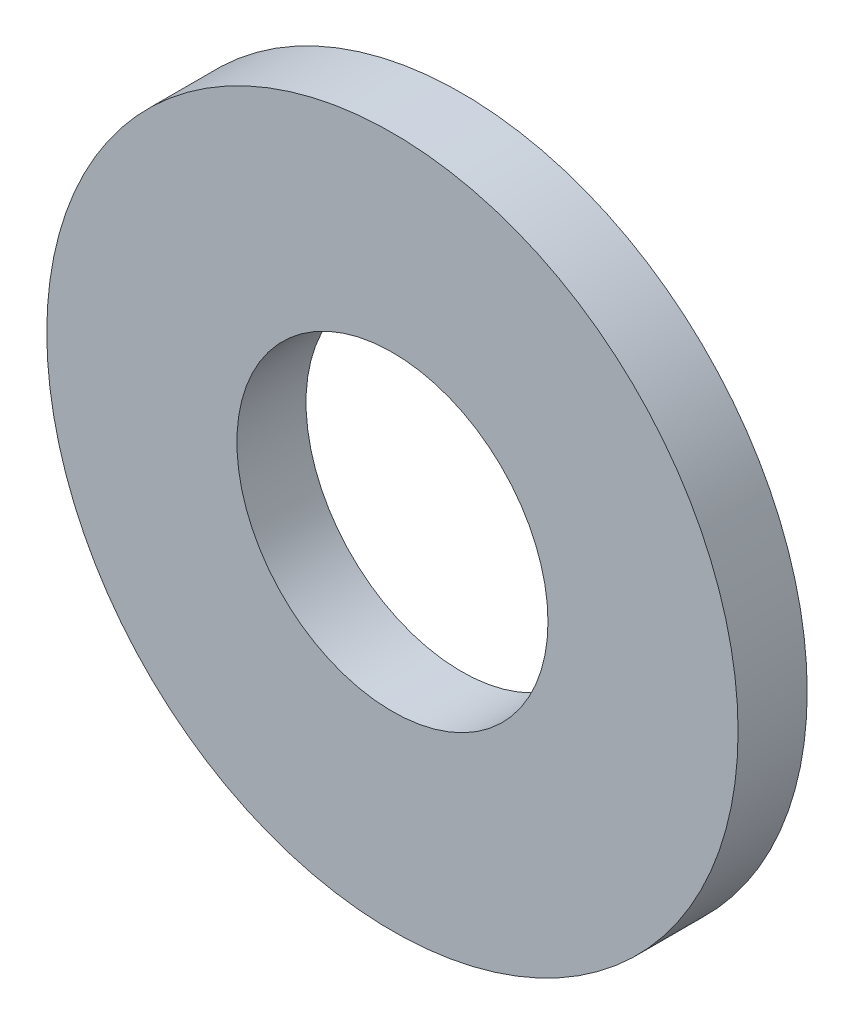
ISO-10303-21;
HEADER;
FILE_DESCRIPTION(('STEP AP214'),'2;1');
FILE_NAME('part.step','',(''),(''),'','','');
FILE_SCHEMA(('AUTOMOTIVE_DESIGN { 1 0 10303 214 1 1 1 1 }'));
ENDSEC;
DATA;
#1=APPLICATION_CONTEXT('core data for automotive mechanical design processes');
#2=APPLICATION_PROTOCOL_DEFINITION('international standard','automotive_design',2000,#1);
#3=PRODUCT_CONTEXT('',#1,'mechanical');
#4=PRODUCT('Part','Part','',(#3));
#5=PRODUCT_RELATED_PRODUCT_CATEGORY('part','',(#4));
#6=PRODUCT_DEFINITION_FORMATION('','',#4);
#7=PRODUCT_DEFINITION_CONTEXT('part definition',#1,'design');
#8=PRODUCT_DEFINITION('design','',#6,#7);
#9=PRODUCT_DEFINITION_SHAPE('','',#8);
#10=(LENGTH_UNIT() NAMED_UNIT(*) SI_UNIT(.MILLI.,.METRE.));
#11=(NAMED_UNIT(*) PLANE_ANGLE_UNIT() SI_UNIT($,.RADIAN.));
#12=(NAMED_UNIT(*) SI_UNIT($,.STERADIAN.) SOLID_ANGLE_UNIT());
#13=UNCERTAINTY_MEASURE_WITH_UNIT(LENGTH_MEASURE(1.E-05),#10,'distance_accuracy_value','');
#14=(GEOMETRIC_REPRESENTATION_CONTEXT(3) GLOBAL_UNCERTAINTY_ASSIGNED_CONTEXT((#13)) GLOBAL_UNIT_ASSIGNED_CONTEXT((#10,
#11,#12)) REPRESENTATION_CONTEXT('',''));
#15=CARTESIAN_POINT('',(0.,0.,0.));
#16=DIRECTION('',(0.,0.,1.));
#17=DIRECTION('',(1.,0.,0.));
#18=AXIS2_PLACEMENT_3D('',#15,#16,#17);
#19=CARTESIAN_POINT('',(0.,0.,1.5875));
#20=DIRECTION('',(0.,0.,1.));
#21=DIRECTION('',(1.,0.,0.));
#22=AXIS2_PLACEMENT_3D('',#19,#20,#21);
#23=PLANE('',#22);
#24=CARTESIAN_POINT('',(0.,0.,1.5875));
#25=DIRECTION('',(0.,0.,1.));
#26=DIRECTION('',(1.,0.,0.));
#27=AXIS2_PLACEMENT_3D('',#24,#25,#26);
#28=CIRCLE('',#27,7.9375);
#29=CARTESIAN_POINT('',(7.9375,0.,1.5875));
#30=VERTEX_POINT('',#29);
#31=EDGE_CURVE('E10',#30,#30,#28,.T.);
#32=ORIENTED_EDGE('',*,*,#31,.T.);
#33=EDGE_LOOP('',(#32));
#34=FACE_BOUND('',#33,.T.);
#35=CARTESIAN_POINT('',(0.,0.,1.5875));
#36=DIRECTION('',(0.,0.,1.));
#37=DIRECTION('',(1.,0.,0.));
#38=AXIS2_PLACEMENT_3D('',#35,#36,#37);
#39=CIRCLE('',#38,3.571875);
#40=CARTESIAN_POINT('',(3.571875,0.,1.5875));
#41=VERTEX_POINT('',#40);
#42=EDGE_CURVE('E50',#41,#41,#39,.T.);
#43=ORIENTED_EDGE('',*,*,#42,.F.);
#44=EDGE_LOOP('',(#43));
#45=FACE_BOUND('',#44,.T.);
#46=ADVANCED_FACE('F37',(#34,#45),#23,.T.);
#47=CARTESIAN_POINT('',(0.,0.,0.));
#48=DIRECTION('',(0.,0.,1.));
#49=DIRECTION('',(1.,0.,0.));
#50=AXIS2_PLACEMENT_3D('',#47,#48,#49);
#51=PLANE('',#50);
#52=CARTESIAN_POINT('',(0.,0.,0.));
#53=DIRECTION('',(0.,0.,1.));
#54=DIRECTION('',(1.,0.,0.));
#55=AXIS2_PLACEMENT_3D('',#52,#53,#54);
#56=CIRCLE('',#55,7.9375);
#57=CARTESIAN_POINT('',(7.9375,0.,0.));
#58=VERTEX_POINT('',#57);
#59=EDGE_CURVE('E41',#58,#58,#56,.T.);
#60=ORIENTED_EDGE('',*,*,#59,.F.);
#61=EDGE_LOOP('',(#60));
#62=FACE_BOUND('',#61,.T.);
#63=CARTESIAN_POINT('',(0.,0.,0.));
#64=DIRECTION('',(0.,0.,1.));
#65=DIRECTION('',(1.,0.,0.));
#66=AXIS2_PLACEMENT_3D('',#63,#64,#65);
#67=CIRCLE('',#66,3.571875);
#68=CARTESIAN_POINT('',(3.571875,0.,0.));
#69=VERTEX_POINT('',#68);
#70=EDGE_CURVE('E52',#69,#69,#67,.T.);
#71=ORIENTED_EDGE('',*,*,#70,.T.);
#72=EDGE_LOOP('',(#71));
#73=FACE_BOUND('',#72,.T.);
#74=ADVANCED_FACE('F64',(#62,#73),#51,.F.);
#75=CARTESIAN_POINT('',(0.,0.,1.5875));
#76=DIRECTION('',(0.,0.,-1.));
#77=DIRECTION('',(-1.,0.,0.));
#78=AXIS2_PLACEMENT_3D('',#75,#76,#77);
#79=CYLINDRICAL_SURFACE('',#78,7.9375);
#80=ORIENTED_EDGE('',*,*,#31,.F.);
#81=EDGE_LOOP('',(#80));
#82=FACE_BOUND('',#81,.T.);
#83=ORIENTED_EDGE('',*,*,#59,.T.);
#84=EDGE_LOOP('',(#83));
#85=FACE_BOUND('',#84,.T.);
#86=ADVANCED_FACE('F39',(#82,#85),#79,.T.);
#87=CARTESIAN_POINT('',(0.,0.,1.5875));
#88=DIRECTION('',(0.,0.,-1.));
#89=DIRECTION('',(-1.,0.,0.));
#90=AXIS2_PLACEMENT_3D('',#87,#88,#89);
#91=CYLINDRICAL_SURFACE('',#90,3.571875);
#92=ORIENTED_EDGE('',*,*,#42,.T.);
#93=EDGE_LOOP('',(#92));
#94=FACE_BOUND('',#93,.T.);
#95=ORIENTED_EDGE('',*,*,#70,.F.);
#96=EDGE_LOOP('',(#95));
#97=FACE_BOUND('',#96,.T.);
#98=ADVANCED_FACE('F60',(#94,#97),#91,.F.);
#99=CLOSED_SHELL('',(#46,#74,#86,#98));
#100=MANIFOLD_SOLID_BREP('B2',#99);
#101=ADVANCED_BREP_SHAPE_REPRESENTATION('',(#18,#100),#14);
#102=SHAPE_DEFINITION_REPRESENTATION(#9,#101);
ENDSEC;
END-ISO-10303-21;
